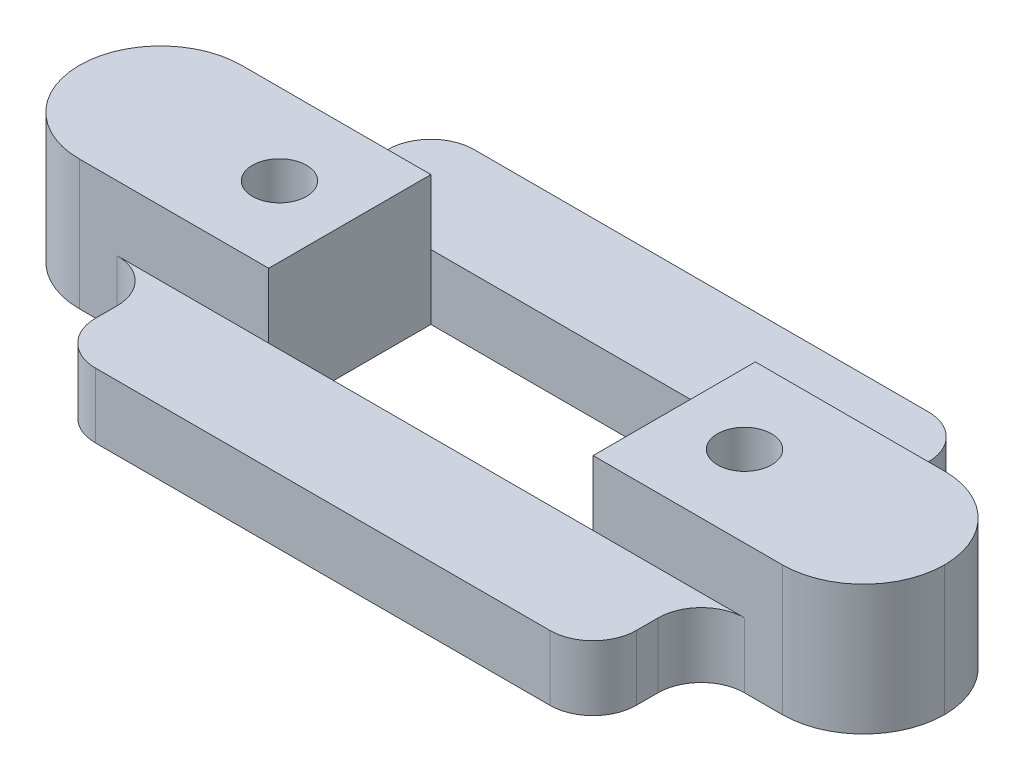
ISO-10303-21;
HEADER;
FILE_DESCRIPTION(('STEP AP214'),'2;1');
FILE_NAME('part.step','',(''),(''),'','','');
FILE_SCHEMA(('AUTOMOTIVE_DESIGN { 1 0 10303 214 1 1 1 1 }'));
ENDSEC;
DATA;
#1=APPLICATION_CONTEXT('core data for automotive mechanical design processes');
#2=APPLICATION_PROTOCOL_DEFINITION('international standard','automotive_design',2000,#1);
#3=PRODUCT_CONTEXT('',#1,'mechanical');
#4=PRODUCT('Part','Part','',(#3));
#5=PRODUCT_RELATED_PRODUCT_CATEGORY('part','',(#4));
#6=PRODUCT_DEFINITION_FORMATION('','',#4);
#7=PRODUCT_DEFINITION_CONTEXT('part definition',#1,'design');
#8=PRODUCT_DEFINITION('design','',#6,#7);
#9=PRODUCT_DEFINITION_SHAPE('','',#8);
#10=(LENGTH_UNIT() NAMED_UNIT(*) SI_UNIT(.MILLI.,.METRE.));
#11=(NAMED_UNIT(*) PLANE_ANGLE_UNIT() SI_UNIT($,.RADIAN.));
#12=(NAMED_UNIT(*) SI_UNIT($,.STERADIAN.) SOLID_ANGLE_UNIT());
#13=UNCERTAINTY_MEASURE_WITH_UNIT(LENGTH_MEASURE(1.E-05),#10,'distance_accuracy_value','');
#14=(GEOMETRIC_REPRESENTATION_CONTEXT(3) GLOBAL_UNCERTAINTY_ASSIGNED_CONTEXT((#13)) GLOBAL_UNIT_ASSIGNED_CONTEXT((#10,
#11,#12)) REPRESENTATION_CONTEXT('',''));
#15=CARTESIAN_POINT('',(0.,0.,0.));
#16=DIRECTION('',(0.,0.,1.));
#17=DIRECTION('',(1.,0.,0.));
#18=AXIS2_PLACEMENT_3D('',#15,#16,#17);
#19=CARTESIAN_POINT('',(0.,6.,0.));
#20=DIRECTION('',(0.,-1.,0.));
#21=DIRECTION('',(0.,0.,-1.));
#22=AXIS2_PLACEMENT_3D('',#19,#20,#21);
#23=PLANE('',#22);
#24=CARTESIAN_POINT('',(10.75,6.,0.));
#25=DIRECTION('',(0.,1.,0.));
#26=DIRECTION('',(0.,0.,-1.));
#27=AXIS2_PLACEMENT_3D('',#24,#25,#26);
#28=CIRCLE('',#27,1.25);
#29=CARTESIAN_POINT('',(10.75,6.,-1.25));
#30=VERTEX_POINT('',#29);
#31=EDGE_CURVE('E274',#30,#30,#28,.T.);
#32=ORIENTED_EDGE('',*,*,#31,.F.);
#33=EDGE_LOOP('',(#32));
#34=FACE_BOUND('',#33,.T.);
#35=DIRECTION('',(-1.,0.,0.));
#36=VECTOR('',#35,1.);
#37=CARTESIAN_POINT('',(12.5,6.,-3.75));
#38=LINE('',#37,#36);
#39=CARTESIAN_POINT('',(16.25,6.,-3.75));
#40=VERTEX_POINT('',#39);
#41=CARTESIAN_POINT('',(7.5,6.,-3.75));
#42=VERTEX_POINT('',#41);
#43=EDGE_CURVE('E304',#40,#42,#38,.T.);
#44=ORIENTED_EDGE('',*,*,#43,.T.);
#45=DIRECTION('',(0.,0.,-1.));
#46=VECTOR('',#45,1.);
#47=CARTESIAN_POINT('',(7.5,6.,3.75));
#48=LINE('',#47,#46);
#49=CARTESIAN_POINT('',(7.5,6.,3.75));
#50=VERTEX_POINT('',#49);
#51=EDGE_CURVE('E262',#50,#42,#48,.T.);
#52=ORIENTED_EDGE('',*,*,#51,.F.);
#53=DIRECTION('',(1.,0.,0.));
#54=VECTOR('',#53,1.);
#55=CARTESIAN_POINT('',(12.5,6.,3.75));
#56=LINE('',#55,#54);
#57=CARTESIAN_POINT('',(16.25,6.,3.75));
#58=VERTEX_POINT('',#57);
#59=EDGE_CURVE('E300',#50,#58,#56,.T.);
#60=ORIENTED_EDGE('',*,*,#59,.T.);
#61=CARTESIAN_POINT('',(16.25,6.,0.));
#62=DIRECTION('',(0.,-1.,0.));
#63=DIRECTION('',(0.,0.,-1.));
#64=AXIS2_PLACEMENT_3D('',#61,#62,#63);
#65=CIRCLE('',#64,3.75);
#66=CARTESIAN_POINT('',(20.,6.,0.));
#67=VERTEX_POINT('',#66);
#68=EDGE_CURVE('E369',#58,#67,#65,.F.);
#69=ORIENTED_EDGE('',*,*,#68,.T.);
#70=CARTESIAN_POINT('',(16.25,6.,0.));
#71=DIRECTION('',(0.,-1.,0.));
#72=DIRECTION('',(0.,0.,-1.));
#73=AXIS2_PLACEMENT_3D('',#70,#71,#72);
#74=CIRCLE('',#73,3.75);
#75=EDGE_CURVE('E366',#67,#40,#74,.F.);
#76=ORIENTED_EDGE('',*,*,#75,.T.);
#77=EDGE_LOOP('',(#44,#52,#60,#69,#76));
#78=FACE_BOUND('',#77,.T.);
#79=ADVANCED_FACE('F43',(#34,#78),#23,.F.);
#80=CARTESIAN_POINT('',(-10.75,6.,0.));
#81=DIRECTION('',(0.,1.,0.));
#82=DIRECTION('',(0.,0.,1.));
#83=AXIS2_PLACEMENT_3D('',#80,#81,#82);
#84=CIRCLE('',#83,1.25);
#85=CARTESIAN_POINT('',(-10.75,6.,1.25));
#86=VERTEX_POINT('',#85);
#87=EDGE_CURVE('E282',#86,#86,#84,.T.);
#88=ORIENTED_EDGE('',*,*,#87,.F.);
#89=EDGE_LOOP('',(#88));
#90=FACE_BOUND('',#89,.T.);
#91=DIRECTION('',(0.,0.,1.));
#92=VECTOR('',#91,1.);
#93=CARTESIAN_POINT('',(-7.5,6.,-3.75));
#94=LINE('',#93,#92);
#95=CARTESIAN_POINT('',(-7.5,6.,-3.75));
#96=VERTEX_POINT('',#95);
#97=CARTESIAN_POINT('',(-7.5,6.,3.75));
#98=VERTEX_POINT('',#97);
#99=EDGE_CURVE('E234',#96,#98,#94,.T.);
#100=ORIENTED_EDGE('',*,*,#99,.F.);
#101=DIRECTION('',(-1.,0.,0.));
#102=VECTOR('',#101,1.);
#103=CARTESIAN_POINT('',(-20.,6.,-3.75));
#104=LINE('',#103,#102);
#105=CARTESIAN_POINT('',(-16.25,6.,-3.75));
#106=VERTEX_POINT('',#105);
#107=EDGE_CURVE('E241',#96,#106,#104,.T.);
#108=ORIENTED_EDGE('',*,*,#107,.T.);
#109=CARTESIAN_POINT('',(-16.25,6.,0.));
#110=DIRECTION('',(0.,-1.,0.));
#111=DIRECTION('',(0.,0.,-1.));
#112=AXIS2_PLACEMENT_3D('',#109,#110,#111);
#113=CIRCLE('',#112,3.75);
#114=CARTESIAN_POINT('',(-20.,6.,0.));
#115=VERTEX_POINT('',#114);
#116=EDGE_CURVE('E361',#106,#115,#113,.F.);
#117=ORIENTED_EDGE('',*,*,#116,.T.);
#118=CARTESIAN_POINT('',(-16.25,6.,0.));
#119=DIRECTION('',(0.,-1.,0.));
#120=DIRECTION('',(0.,0.,-1.));
#121=AXIS2_PLACEMENT_3D('',#118,#119,#120);
#122=CIRCLE('',#121,3.75);
#123=CARTESIAN_POINT('',(-16.25,6.,3.75));
#124=VERTEX_POINT('',#123);
#125=EDGE_CURVE('E236',#115,#124,#122,.F.);
#126=ORIENTED_EDGE('',*,*,#125,.T.);
#127=DIRECTION('',(1.,0.,0.));
#128=VECTOR('',#127,1.);
#129=CARTESIAN_POINT('',(-20.,6.,3.75));
#130=LINE('',#129,#128);
#131=EDGE_CURVE('E229',#124,#98,#130,.T.);
#132=ORIENTED_EDGE('',*,*,#131,.T.);
#133=EDGE_LOOP('',(#100,#108,#117,#126,#132));
#134=FACE_BOUND('',#133,.T.);
#135=ADVANCED_FACE('F231',(#90,#134),#23,.F.);
#136=CARTESIAN_POINT('',(12.5,6.,-8.75));
#137=DIRECTION('',(-1.,0.,0.));
#138=DIRECTION('',(0.,0.,1.));
#139=AXIS2_PLACEMENT_3D('',#136,#137,#138);
#140=PLANE('',#139);
#141=DIRECTION('',(0.,0.,-1.));
#142=VECTOR('',#141,1.);
#143=CARTESIAN_POINT('',(12.5,0.,-8.75));
#144=LINE('',#143,#142);
#145=CARTESIAN_POINT('',(12.5,0.,-5.75));
#146=VERTEX_POINT('',#145);
#147=CARTESIAN_POINT('',(12.5,0.,-6.75));
#148=VERTEX_POINT('',#147);
#149=EDGE_CURVE('E316',#146,#148,#144,.T.);
#150=ORIENTED_EDGE('',*,*,#149,.T.);
#151=DIRECTION('',(0.,-1.,0.));
#152=VECTOR('',#151,1.);
#153=CARTESIAN_POINT('',(12.5,6.,-6.75));
#154=LINE('',#153,#152);
#155=CARTESIAN_POINT('',(12.5,3.,-6.75));
#156=VERTEX_POINT('',#155);
#157=EDGE_CURVE('E447',#148,#156,#154,.F.);
#158=ORIENTED_EDGE('',*,*,#157,.T.);
#159=DIRECTION('',(0.,0.,-1.));
#160=VECTOR('',#159,1.);
#161=CARTESIAN_POINT('',(12.5,3.,-8.75));
#162=LINE('',#161,#160);
#163=CARTESIAN_POINT('',(12.5,3.,-5.75));
#164=VERTEX_POINT('',#163);
#165=EDGE_CURVE('E390',#164,#156,#162,.T.);
#166=ORIENTED_EDGE('',*,*,#165,.F.);
#167=DIRECTION('',(0.,-1.,0.));
#168=VECTOR('',#167,1.);
#169=CARTESIAN_POINT('',(12.5,0.,-5.75));
#170=LINE('',#169,#168);
#171=EDGE_CURVE('E443',#164,#146,#170,.T.);
#172=ORIENTED_EDGE('',*,*,#171,.T.);
#173=EDGE_LOOP('',(#150,#158,#166,#172));
#174=FACE_BOUND('',#173,.T.);
#175=ADVANCED_FACE('F628',(#174),#140,.F.);
#176=CARTESIAN_POINT('',(-12.5,6.,-8.75));
#177=DIRECTION('',(0.,0.,1.));
#178=DIRECTION('',(1.,0.,0.));
#179=AXIS2_PLACEMENT_3D('',#176,#177,#178);
#180=PLANE('',#179);
#181=DIRECTION('',(1.,0.,0.));
#182=VECTOR('',#181,1.);
#183=CARTESIAN_POINT('',(-20.,3.,-8.75));
#184=LINE('',#183,#182);
#185=CARTESIAN_POINT('',(-10.5,3.,-8.75));
#186=VERTEX_POINT('',#185);
#187=CARTESIAN_POINT('',(10.5,3.,-8.75));
#188=VERTEX_POINT('',#187);
#189=EDGE_CURVE('E577',#186,#188,#184,.T.);
#190=ORIENTED_EDGE('',*,*,#189,.T.);
#191=DIRECTION('',(0.,-1.,0.));
#192=VECTOR('',#191,1.);
#193=CARTESIAN_POINT('',(10.5,6.,-8.75));
#194=LINE('',#193,#192);
#195=CARTESIAN_POINT('',(10.5,0.,-8.75));
#196=VERTEX_POINT('',#195);
#197=EDGE_CURVE('E439',#188,#196,#194,.T.);
#198=ORIENTED_EDGE('',*,*,#197,.T.);
#199=DIRECTION('',(-1.,0.,0.));
#200=VECTOR('',#199,1.);
#201=CARTESIAN_POINT('',(-12.5,0.,-8.75));
#202=LINE('',#201,#200);
#203=CARTESIAN_POINT('',(-10.5,0.,-8.75));
#204=VERTEX_POINT('',#203);
#205=EDGE_CURVE('E320',#196,#204,#202,.T.);
#206=ORIENTED_EDGE('',*,*,#205,.T.);
#207=DIRECTION('',(0.,-1.,0.));
#208=VECTOR('',#207,1.);
#209=CARTESIAN_POINT('',(-10.5,6.,-8.75));
#210=LINE('',#209,#208);
#211=EDGE_CURVE('E436',#204,#186,#210,.F.);
#212=ORIENTED_EDGE('',*,*,#211,.T.);
#213=EDGE_LOOP('',(#190,#198,#206,#212));
#214=FACE_BOUND('',#213,.T.);
#215=ADVANCED_FACE('F625',(#214),#180,.F.);
#216=CARTESIAN_POINT('',(-12.5,6.,-3.75));
#217=DIRECTION('',(1.,0.,0.));
#218=DIRECTION('',(0.,0.,-1.));
#219=AXIS2_PLACEMENT_3D('',#216,#217,#218);
#220=PLANE('',#219);
#221=DIRECTION('',(0.,0.,1.));
#222=VECTOR('',#221,1.);
#223=CARTESIAN_POINT('',(-12.5,3.,-3.75));
#224=LINE('',#223,#222);
#225=CARTESIAN_POINT('',(-12.5,3.,-6.75));
#226=VERTEX_POINT('',#225);
#227=CARTESIAN_POINT('',(-12.5,3.,-5.75));
#228=VERTEX_POINT('',#227);
#229=EDGE_CURVE('E505',#226,#228,#224,.T.);
#230=ORIENTED_EDGE('',*,*,#229,.F.);
#231=DIRECTION('',(0.,-1.,0.));
#232=VECTOR('',#231,1.);
#233=CARTESIAN_POINT('',(-12.5,6.,-6.75));
#234=LINE('',#233,#232);
#235=CARTESIAN_POINT('',(-12.5,0.,-6.75));
#236=VERTEX_POINT('',#235);
#237=EDGE_CURVE('E462',#226,#236,#234,.T.);
#238=ORIENTED_EDGE('',*,*,#237,.T.);
#239=DIRECTION('',(0.,0.,1.));
#240=VECTOR('',#239,1.);
#241=CARTESIAN_POINT('',(-12.5,0.,-3.75));
#242=LINE('',#241,#240);
#243=CARTESIAN_POINT('',(-12.5,0.,-5.75));
#244=VERTEX_POINT('',#243);
#245=EDGE_CURVE('E324',#236,#244,#242,.T.);
#246=ORIENTED_EDGE('',*,*,#245,.T.);
#247=DIRECTION('',(0.,-1.,0.));
#248=VECTOR('',#247,1.);
#249=CARTESIAN_POINT('',(-12.5,3.,-5.75));
#250=LINE('',#249,#248);
#251=EDGE_CURVE('E459',#244,#228,#250,.F.);
#252=ORIENTED_EDGE('',*,*,#251,.T.);
#253=EDGE_LOOP('',(#230,#238,#246,#252));
#254=FACE_BOUND('',#253,.T.);
#255=ADVANCED_FACE('F499',(#254),#220,.F.);
#256=CARTESIAN_POINT('',(-12.5,6.,3.75));
#257=DIRECTION('',(1.,0.,0.));
#258=DIRECTION('',(0.,0.,-1.));
#259=AXIS2_PLACEMENT_3D('',#256,#257,#258);
#260=PLANE('',#259);
#261=DIRECTION('',(0.,0.,1.));
#262=VECTOR('',#261,1.);
#263=CARTESIAN_POINT('',(-12.5,0.,3.75));
#264=LINE('',#263,#262);
#265=CARTESIAN_POINT('',(-12.5,0.,5.75));
#266=VERTEX_POINT('',#265);
#267=CARTESIAN_POINT('',(-12.5,0.,6.75));
#268=VERTEX_POINT('',#267);
#269=EDGE_CURVE('E334',#266,#268,#264,.T.);
#270=ORIENTED_EDGE('',*,*,#269,.T.);
#271=DIRECTION('',(0.,-1.,0.));
#272=VECTOR('',#271,1.);
#273=CARTESIAN_POINT('',(-12.5,6.,6.75));
#274=LINE('',#273,#272);
#275=CARTESIAN_POINT('',(-12.5,3.,6.75));
#276=VERTEX_POINT('',#275);
#277=EDGE_CURVE('E430',#268,#276,#274,.F.);
#278=ORIENTED_EDGE('',*,*,#277,.T.);
#279=DIRECTION('',(0.,0.,1.));
#280=VECTOR('',#279,1.);
#281=CARTESIAN_POINT('',(-12.5,3.,3.75));
#282=LINE('',#281,#280);
#283=CARTESIAN_POINT('',(-12.5,3.,5.75));
#284=VERTEX_POINT('',#283);
#285=EDGE_CURVE('E509',#284,#276,#282,.T.);
#286=ORIENTED_EDGE('',*,*,#285,.F.);
#287=DIRECTION('',(0.,-1.,0.));
#288=VECTOR('',#287,1.);
#289=CARTESIAN_POINT('',(-12.5,0.,5.75));
#290=LINE('',#289,#288);
#291=EDGE_CURVE('E426',#284,#266,#290,.T.);
#292=ORIENTED_EDGE('',*,*,#291,.T.);
#293=EDGE_LOOP('',(#270,#278,#286,#292));
#294=FACE_BOUND('',#293,.T.);
#295=ADVANCED_FACE('F613',(#294),#260,.F.);
#296=CARTESIAN_POINT('',(-12.5,6.,8.75));
#297=DIRECTION('',(0.,0.,-1.));
#298=DIRECTION('',(-1.,0.,0.));
#299=AXIS2_PLACEMENT_3D('',#296,#297,#298);
#300=PLANE('',#299);
#301=DIRECTION('',(1.,0.,0.));
#302=VECTOR('',#301,1.);
#303=CARTESIAN_POINT('',(-12.5,0.,8.75));
#304=LINE('',#303,#302);
#305=CARTESIAN_POINT('',(-10.5,0.,8.75));
#306=VERTEX_POINT('',#305);
#307=CARTESIAN_POINT('',(10.5,0.,8.75));
#308=VERTEX_POINT('',#307);
#309=EDGE_CURVE('E338',#306,#308,#304,.T.);
#310=ORIENTED_EDGE('',*,*,#309,.T.);
#311=DIRECTION('',(0.,-1.,0.));
#312=VECTOR('',#311,1.);
#313=CARTESIAN_POINT('',(10.5,6.,8.75));
#314=LINE('',#313,#312);
#315=CARTESIAN_POINT('',(10.5,3.,8.75));
#316=VERTEX_POINT('',#315);
#317=EDGE_CURVE('E417',#308,#316,#314,.F.);
#318=ORIENTED_EDGE('',*,*,#317,.T.);
#319=DIRECTION('',(1.,0.,0.));
#320=VECTOR('',#319,1.);
#321=CARTESIAN_POINT('',(-20.,3.,8.75));
#322=LINE('',#321,#320);
#323=CARTESIAN_POINT('',(-10.5,3.,8.75));
#324=VERTEX_POINT('',#323);
#325=EDGE_CURVE('E571',#324,#316,#322,.T.);
#326=ORIENTED_EDGE('',*,*,#325,.F.);
#327=DIRECTION('',(0.,-1.,0.));
#328=VECTOR('',#327,1.);
#329=CARTESIAN_POINT('',(-10.5,6.,8.75));
#330=LINE('',#329,#328);
#331=EDGE_CURVE('E413',#324,#306,#330,.T.);
#332=ORIENTED_EDGE('',*,*,#331,.T.);
#333=EDGE_LOOP('',(#310,#318,#326,#332));
#334=FACE_BOUND('',#333,.T.);
#335=ADVANCED_FACE('F609',(#334),#300,.F.);
#336=CARTESIAN_POINT('',(12.5,6.,8.75));
#337=DIRECTION('',(-1.,0.,0.));
#338=DIRECTION('',(0.,0.,1.));
#339=AXIS2_PLACEMENT_3D('',#336,#337,#338);
#340=PLANE('',#339);
#341=DIRECTION('',(0.,0.,-1.));
#342=VECTOR('',#341,1.);
#343=CARTESIAN_POINT('',(12.5,0.,8.75));
#344=LINE('',#343,#342);
#345=CARTESIAN_POINT('',(12.5,0.,6.75));
#346=VERTEX_POINT('',#345);
#347=CARTESIAN_POINT('',(12.5,0.,5.75));
#348=VERTEX_POINT('',#347);
#349=EDGE_CURVE('E305',#346,#348,#344,.T.);
#350=ORIENTED_EDGE('',*,*,#349,.T.);
#351=DIRECTION('',(0.,-1.,0.));
#352=VECTOR('',#351,1.);
#353=CARTESIAN_POINT('',(12.5,3.,5.75));
#354=LINE('',#353,#352);
#355=CARTESIAN_POINT('',(12.5,3.,5.75));
#356=VERTEX_POINT('',#355);
#357=EDGE_CURVE('E398',#348,#356,#354,.F.);
#358=ORIENTED_EDGE('',*,*,#357,.T.);
#359=DIRECTION('',(0.,0.,-1.));
#360=VECTOR('',#359,1.);
#361=CARTESIAN_POINT('',(12.5,3.,8.75));
#362=LINE('',#361,#360);
#363=CARTESIAN_POINT('',(12.5,3.,6.75));
#364=VERTEX_POINT('',#363);
#365=EDGE_CURVE('E515',#364,#356,#362,.T.);
#366=ORIENTED_EDGE('',*,*,#365,.F.);
#367=DIRECTION('',(0.,-1.,0.));
#368=VECTOR('',#367,1.);
#369=CARTESIAN_POINT('',(12.5,6.,6.75));
#370=LINE('',#369,#368);
#371=EDGE_CURVE('E394',#364,#346,#370,.T.);
#372=ORIENTED_EDGE('',*,*,#371,.T.);
#373=EDGE_LOOP('',(#350,#358,#366,#372));
#374=FACE_BOUND('',#373,.T.);
#375=ADVANCED_FACE('F606',(#374),#340,.F.);
#376=CARTESIAN_POINT('',(-7.5,6.,3.75));
#377=DIRECTION('',(0.,0.,-1.));
#378=DIRECTION('',(-1.,0.,0.));
#379=AXIS2_PLACEMENT_3D('',#376,#377,#378);
#380=PLANE('',#379);
#381=DIRECTION('',(0.,-1.,0.));
#382=VECTOR('',#381,1.);
#383=CARTESIAN_POINT('',(-7.5,6.,3.75));
#384=LINE('',#383,#382);
#385=CARTESIAN_POINT('',(-7.5,3.,3.75));
#386=VERTEX_POINT('',#385);
#387=CARTESIAN_POINT('',(-7.5,0.,3.75));
#388=VERTEX_POINT('',#387);
#389=EDGE_CURVE('E254',#386,#388,#384,.T.);
#390=ORIENTED_EDGE('',*,*,#389,.F.);
#391=DIRECTION('',(1.,0.,0.));
#392=VECTOR('',#391,1.);
#393=CARTESIAN_POINT('',(-20.,3.,3.75));
#394=LINE('',#393,#392);
#395=CARTESIAN_POINT('',(7.5,3.,3.75));
#396=VERTEX_POINT('',#395);
#397=EDGE_CURVE('E560',#386,#396,#394,.T.);
#398=ORIENTED_EDGE('',*,*,#397,.T.);
#399=DIRECTION('',(0.,-1.,0.));
#400=VECTOR('',#399,1.);
#401=CARTESIAN_POINT('',(7.5,6.,3.75));
#402=LINE('',#401,#400);
#403=CARTESIAN_POINT('',(7.5,0.,3.75));
#404=VERTEX_POINT('',#403);
#405=EDGE_CURVE('E296',#396,#404,#402,.T.);
#406=ORIENTED_EDGE('',*,*,#405,.T.);
#407=DIRECTION('',(1.,0.,0.));
#408=VECTOR('',#407,1.);
#409=CARTESIAN_POINT('',(-7.5,0.,3.75));
#410=LINE('',#409,#408);
#411=EDGE_CURVE('E281',#388,#404,#410,.T.);
#412=ORIENTED_EDGE('',*,*,#411,.F.);
#413=EDGE_LOOP('',(#390,#398,#406,#412));
#414=FACE_BOUND('',#413,.T.);
#415=ADVANCED_FACE('F567',(#414),#380,.T.);
#416=CARTESIAN_POINT('',(-7.5,6.,-3.75));
#417=DIRECTION('',(0.,0.,1.));
#418=DIRECTION('',(1.,0.,0.));
#419=AXIS2_PLACEMENT_3D('',#416,#417,#418);
#420=PLANE('',#419);
#421=DIRECTION('',(0.,-1.,0.));
#422=VECTOR('',#421,1.);
#423=CARTESIAN_POINT('',(7.5,6.,-3.75));
#424=LINE('',#423,#422);
#425=CARTESIAN_POINT('',(7.5,3.,-3.75));
#426=VERTEX_POINT('',#425);
#427=CARTESIAN_POINT('',(7.5,0.,-3.75));
#428=VERTEX_POINT('',#427);
#429=EDGE_CURVE('E291',#426,#428,#424,.T.);
#430=ORIENTED_EDGE('',*,*,#429,.F.);
#431=DIRECTION('',(1.,0.,0.));
#432=VECTOR('',#431,1.);
#433=CARTESIAN_POINT('',(-20.,3.,-3.75));
#434=LINE('',#433,#432);
#435=CARTESIAN_POINT('',(-7.5,3.,-3.75));
#436=VERTEX_POINT('',#435);
#437=EDGE_CURVE('E584',#436,#426,#434,.T.);
#438=ORIENTED_EDGE('',*,*,#437,.F.);
#439=DIRECTION('',(0.,-1.,0.));
#440=VECTOR('',#439,1.);
#441=CARTESIAN_POINT('',(-7.5,6.,-3.75));
#442=LINE('',#441,#440);
#443=CARTESIAN_POINT('',(-7.5,0.,-3.75));
#444=VERTEX_POINT('',#443);
#445=EDGE_CURVE('E268',#436,#444,#442,.T.);
#446=ORIENTED_EDGE('',*,*,#445,.T.);
#447=DIRECTION('',(-1.,0.,0.));
#448=VECTOR('',#447,1.);
#449=CARTESIAN_POINT('',(-7.5,0.,-3.75));
#450=LINE('',#449,#448);
#451=EDGE_CURVE('E263',#428,#444,#450,.T.);
#452=ORIENTED_EDGE('',*,*,#451,.F.);
#453=EDGE_LOOP('',(#430,#438,#446,#452));
#454=FACE_BOUND('',#453,.T.);
#455=ADVANCED_FACE('F591',(#454),#420,.T.);
#456=CARTESIAN_POINT('',(0.,0.,0.));
#457=DIRECTION('',(0.,-1.,0.));
#458=DIRECTION('',(0.,0.,-1.));
#459=AXIS2_PLACEMENT_3D('',#456,#457,#458);
#460=PLANE('',#459);
#461=CARTESIAN_POINT('',(-10.75,0.,0.));
#462=DIRECTION('',(0.,1.,0.));
#463=DIRECTION('',(0.,0.,1.));
#464=AXIS2_PLACEMENT_3D('',#461,#462,#463);
#465=CIRCLE('',#464,1.25);
#466=CARTESIAN_POINT('',(-10.75,0.,1.25));
#467=VERTEX_POINT('',#466);
#468=EDGE_CURVE('E522',#467,#467,#465,.T.);
#469=ORIENTED_EDGE('',*,*,#468,.T.);
#470=EDGE_LOOP('',(#469));
#471=FACE_BOUND('',#470,.T.);
#472=CARTESIAN_POINT('',(10.75,0.,0.));
#473=DIRECTION('',(0.,1.,0.));
#474=DIRECTION('',(0.,0.,-1.));
#475=AXIS2_PLACEMENT_3D('',#472,#473,#474);
#476=CIRCLE('',#475,1.25);
#477=CARTESIAN_POINT('',(10.75,0.,-1.25));
#478=VERTEX_POINT('',#477);
#479=EDGE_CURVE('E525',#478,#478,#476,.T.);
#480=ORIENTED_EDGE('',*,*,#479,.T.);
#481=EDGE_LOOP('',(#480));
#482=FACE_BOUND('',#481,.T.);
#483=ORIENTED_EDGE('',*,*,#349,.F.);
#484=CARTESIAN_POINT('',(10.5,0.,6.75));
#485=DIRECTION('',(0.,-1.,0.));
#486=DIRECTION('',(0.,0.,-1.));
#487=AXIS2_PLACEMENT_3D('',#484,#485,#486);
#488=CIRCLE('',#487,2.);
#489=EDGE_CURVE('E410',#346,#308,#488,.T.);
#490=ORIENTED_EDGE('',*,*,#489,.T.);
#491=ORIENTED_EDGE('',*,*,#309,.F.);
#492=CARTESIAN_POINT('',(-10.5,0.,6.75));
#493=DIRECTION('',(0.,-1.,0.));
#494=DIRECTION('',(0.,0.,-1.));
#495=AXIS2_PLACEMENT_3D('',#492,#493,#494);
#496=CIRCLE('',#495,2.);
#497=EDGE_CURVE('E407',#306,#268,#496,.T.);
#498=ORIENTED_EDGE('',*,*,#497,.T.);
#499=ORIENTED_EDGE('',*,*,#269,.F.);
#500=CARTESIAN_POINT('',(-14.5,0.,5.75));
#501=DIRECTION('',(0.,-1.,0.));
#502=DIRECTION('',(0.,0.,-1.));
#503=AXIS2_PLACEMENT_3D('',#500,#501,#502);
#504=CIRCLE('',#503,2.);
#505=CARTESIAN_POINT('',(-14.5,0.,3.75));
#506=VERTEX_POINT('',#505);
#507=EDGE_CURVE('E476',#266,#506,#504,.F.);
#508=ORIENTED_EDGE('',*,*,#507,.T.);
#509=DIRECTION('',(1.,0.,0.));
#510=VECTOR('',#509,1.);
#511=CARTESIAN_POINT('',(-20.,0.,3.75));
#512=LINE('',#511,#510);
#513=CARTESIAN_POINT('',(-16.25,0.,3.75));
#514=VERTEX_POINT('',#513);
#515=EDGE_CURVE('E331',#514,#506,#512,.T.);
#516=ORIENTED_EDGE('',*,*,#515,.F.);
#517=CARTESIAN_POINT('',(-16.25,0.,0.));
#518=DIRECTION('',(0.,-1.,0.));
#519=DIRECTION('',(0.,0.,-1.));
#520=AXIS2_PLACEMENT_3D('',#517,#518,#519);
#521=CIRCLE('',#520,3.75);
#522=CARTESIAN_POINT('',(-20.,0.,0.));
#523=VERTEX_POINT('',#522);
#524=EDGE_CURVE('E348',#514,#523,#521,.T.);
#525=ORIENTED_EDGE('',*,*,#524,.T.);
#526=CARTESIAN_POINT('',(-16.25,0.,0.));
#527=DIRECTION('',(0.,-1.,0.));
#528=DIRECTION('',(0.,0.,-1.));
#529=AXIS2_PLACEMENT_3D('',#526,#527,#528);
#530=CIRCLE('',#529,3.75);
#531=CARTESIAN_POINT('',(-16.25,0.,-3.75));
#532=VERTEX_POINT('',#531);
#533=EDGE_CURVE('E240',#523,#532,#530,.T.);
#534=ORIENTED_EDGE('',*,*,#533,.T.);
#535=DIRECTION('',(-1.,0.,0.));
#536=VECTOR('',#535,1.);
#537=CARTESIAN_POINT('',(-20.,0.,-3.75));
#538=LINE('',#537,#536);
#539=CARTESIAN_POINT('',(-14.5,0.,-3.75));
#540=VERTEX_POINT('',#539);
#541=EDGE_CURVE('E328',#540,#532,#538,.T.);
#542=ORIENTED_EDGE('',*,*,#541,.F.);
#543=CARTESIAN_POINT('',(-14.5,0.,-5.75));
#544=DIRECTION('',(0.,-1.,0.));
#545=DIRECTION('',(0.,0.,-1.));
#546=AXIS2_PLACEMENT_3D('',#543,#544,#545);
#547=CIRCLE('',#546,2.);
#548=EDGE_CURVE('E52',#540,#244,#547,.F.);
#549=ORIENTED_EDGE('',*,*,#548,.T.);
#550=ORIENTED_EDGE('',*,*,#245,.F.);
#551=CARTESIAN_POINT('',(-10.5,0.,-6.75));
#552=DIRECTION('',(0.,-1.,0.));
#553=DIRECTION('',(0.,0.,-1.));
#554=AXIS2_PLACEMENT_3D('',#551,#552,#553);
#555=CIRCLE('',#554,2.);
#556=EDGE_CURVE('E401',#236,#204,#555,.T.);
#557=ORIENTED_EDGE('',*,*,#556,.T.);
#558=ORIENTED_EDGE('',*,*,#205,.F.);
#559=CARTESIAN_POINT('',(10.5,0.,-6.75));
#560=DIRECTION('',(0.,-1.,0.));
#561=DIRECTION('',(0.,0.,-1.));
#562=AXIS2_PLACEMENT_3D('',#559,#560,#561);
#563=CIRCLE('',#562,2.);
#564=EDGE_CURVE('E404',#196,#148,#563,.T.);
#565=ORIENTED_EDGE('',*,*,#564,.T.);
#566=ORIENTED_EDGE('',*,*,#149,.F.);
#567=CARTESIAN_POINT('',(14.5,0.,-5.75));
#568=DIRECTION('',(0.,-1.,0.));
#569=DIRECTION('',(0.,0.,-1.));
#570=AXIS2_PLACEMENT_3D('',#567,#568,#569);
#571=CIRCLE('',#570,2.);
#572=CARTESIAN_POINT('',(14.5,0.,-3.75));
#573=VERTEX_POINT('',#572);
#574=EDGE_CURVE('E482',#146,#573,#571,.F.);
#575=ORIENTED_EDGE('',*,*,#574,.T.);
#576=DIRECTION('',(-1.,0.,0.));
#577=VECTOR('',#576,1.);
#578=CARTESIAN_POINT('',(12.5,0.,-3.75));
#579=LINE('',#578,#577);
#580=CARTESIAN_POINT('',(16.25,0.,-3.75));
#581=VERTEX_POINT('',#580);
#582=EDGE_CURVE('E312',#581,#573,#579,.T.);
#583=ORIENTED_EDGE('',*,*,#582,.F.);
#584=CARTESIAN_POINT('',(16.25,0.,0.));
#585=DIRECTION('',(0.,-1.,0.));
#586=DIRECTION('',(0.,0.,-1.));
#587=AXIS2_PLACEMENT_3D('',#584,#585,#586);
#588=CIRCLE('',#587,3.75);
#589=CARTESIAN_POINT('',(20.,0.,0.));
#590=VERTEX_POINT('',#589);
#591=EDGE_CURVE('E351',#581,#590,#588,.T.);
#592=ORIENTED_EDGE('',*,*,#591,.T.);
#593=CARTESIAN_POINT('',(16.25,0.,0.));
#594=DIRECTION('',(0.,-1.,0.));
#595=DIRECTION('',(0.,0.,-1.));
#596=AXIS2_PLACEMENT_3D('',#593,#594,#595);
#597=CIRCLE('',#596,3.75);
#598=CARTESIAN_POINT('',(16.25,0.,3.75));
#599=VERTEX_POINT('',#598);
#600=EDGE_CURVE('E354',#590,#599,#597,.T.);
#601=ORIENTED_EDGE('',*,*,#600,.T.);
#602=DIRECTION('',(1.,0.,0.));
#603=VECTOR('',#602,1.);
#604=CARTESIAN_POINT('',(12.5,0.,3.75));
#605=LINE('',#604,#603);
#606=CARTESIAN_POINT('',(14.5,0.,3.75));
#607=VERTEX_POINT('',#606);
#608=EDGE_CURVE('E253',#607,#599,#605,.T.);
#609=ORIENTED_EDGE('',*,*,#608,.F.);
#610=CARTESIAN_POINT('',(14.5,0.,5.75));
#611=DIRECTION('',(0.,-1.,0.));
#612=DIRECTION('',(0.,0.,-1.));
#613=AXIS2_PLACEMENT_3D('',#610,#611,#612);
#614=CIRCLE('',#613,2.);
#615=EDGE_CURVE('E469',#607,#348,#614,.F.);
#616=ORIENTED_EDGE('',*,*,#615,.T.);
#617=EDGE_LOOP('',(#483,#490,#491,#498,#499,#508,#516,#525,#534,#542,#549,#550,#557,#558,#565,
#566,#575,#583,#592,#601,#609,#616));
#618=FACE_BOUND('',#617,.T.);
#619=ORIENTED_EDGE('',*,*,#451,.T.);
#620=DIRECTION('',(0.,0.,1.));
#621=VECTOR('',#620,1.);
#622=CARTESIAN_POINT('',(-7.5,0.,-3.75));
#623=LINE('',#622,#621);
#624=EDGE_CURVE('E277',#444,#388,#623,.T.);
#625=ORIENTED_EDGE('',*,*,#624,.T.);
#626=ORIENTED_EDGE('',*,*,#411,.T.);
#627=DIRECTION('',(0.,0.,-1.));
#628=VECTOR('',#627,1.);
#629=CARTESIAN_POINT('',(7.5,0.,3.75));
#630=LINE('',#629,#628);
#631=EDGE_CURVE('E271',#404,#428,#630,.T.);
#632=ORIENTED_EDGE('',*,*,#631,.T.);
#633=EDGE_LOOP('',(#619,#625,#626,#632));
#634=FACE_BOUND('',#633,.T.);
#635=ADVANCED_FACE('F492',(#471,#482,#618,#634),#460,.T.);
#636=CARTESIAN_POINT('',(12.5,6.,3.75));
#637=DIRECTION('',(0.,0.,-1.));
#638=DIRECTION('',(-1.,0.,0.));
#639=AXIS2_PLACEMENT_3D('',#636,#637,#638);
#640=PLANE('',#639);
#641=CARTESIAN_POINT('',(14.5,3.,3.75));
#642=VERTEX_POINT('',#641);
#643=EDGE_CURVE('E555',#396,#642,#394,.T.);
#644=ORIENTED_EDGE('',*,*,#643,.T.);
#645=DIRECTION('',(0.,-1.,0.));
#646=VECTOR('',#645,1.);
#647=CARTESIAN_POINT('',(14.5,0.,3.75));
#648=LINE('',#647,#646);
#649=EDGE_CURVE('E381',#642,#607,#648,.T.);
#650=ORIENTED_EDGE('',*,*,#649,.T.);
#651=ORIENTED_EDGE('',*,*,#608,.T.);
#652=DIRECTION('',(0.,-1.,0.));
#653=VECTOR('',#652,1.);
#654=CARTESIAN_POINT('',(16.25,6.,3.75));
#655=LINE('',#654,#653);
#656=EDGE_CURVE('E358',#599,#58,#655,.F.);
#657=ORIENTED_EDGE('',*,*,#656,.T.);
#658=ORIENTED_EDGE('',*,*,#59,.F.);
#659=EDGE_CURVE('E297',#50,#396,#402,.T.);
#660=ORIENTED_EDGE('',*,*,#659,.T.);
#661=EDGE_LOOP('',(#644,#650,#651,#657,#658,#660));
#662=FACE_BOUND('',#661,.T.);
#663=ADVANCED_FACE('F554',(#662),#640,.F.);
#664=CARTESIAN_POINT('',(12.5,6.,-3.75));
#665=DIRECTION('',(0.,0.,1.));
#666=DIRECTION('',(1.,0.,0.));
#667=AXIS2_PLACEMENT_3D('',#664,#665,#666);
#668=PLANE('',#667);
#669=ORIENTED_EDGE('',*,*,#582,.T.);
#670=DIRECTION('',(0.,-1.,0.));
#671=VECTOR('',#670,1.);
#672=CARTESIAN_POINT('',(14.5,3.,-3.75));
#673=LINE('',#672,#671);
#674=CARTESIAN_POINT('',(14.5,3.,-3.75));
#675=VERTEX_POINT('',#674);
#676=EDGE_CURVE('E456',#573,#675,#673,.F.);
#677=ORIENTED_EDGE('',*,*,#676,.T.);
#678=EDGE_CURVE('E66',#426,#675,#434,.T.);
#679=ORIENTED_EDGE('',*,*,#678,.F.);
#680=EDGE_CURVE('E292',#42,#426,#424,.T.);
#681=ORIENTED_EDGE('',*,*,#680,.F.);
#682=ORIENTED_EDGE('',*,*,#43,.F.);
#683=DIRECTION('',(0.,-1.,0.));
#684=VECTOR('',#683,1.);
#685=CARTESIAN_POINT('',(16.25,6.,-3.75));
#686=LINE('',#685,#684);
#687=EDGE_CURVE('E372',#40,#581,#686,.T.);
#688=ORIENTED_EDGE('',*,*,#687,.T.);
#689=EDGE_LOOP('',(#669,#677,#679,#681,#682,#688));
#690=FACE_BOUND('',#689,.T.);
#691=ADVANCED_FACE('F546',(#690),#668,.F.);
#692=CARTESIAN_POINT('',(-20.,6.,-3.75));
#693=DIRECTION('',(0.,0.,1.));
#694=DIRECTION('',(1.,0.,0.));
#695=AXIS2_PLACEMENT_3D('',#692,#693,#694);
#696=PLANE('',#695);
#697=CARTESIAN_POINT('',(-14.5,3.,-3.75));
#698=VERTEX_POINT('',#697);
#699=EDGE_CURVE('E59',#698,#436,#434,.T.);
#700=ORIENTED_EDGE('',*,*,#699,.F.);
#701=DIRECTION('',(0.,-1.,0.));
#702=VECTOR('',#701,1.);
#703=CARTESIAN_POINT('',(-14.5,0.,-3.75));
#704=LINE('',#703,#702);
#705=EDGE_CURVE('E466',#698,#540,#704,.T.);
#706=ORIENTED_EDGE('',*,*,#705,.T.);
#707=ORIENTED_EDGE('',*,*,#541,.T.);
#708=DIRECTION('',(0.,-1.,0.));
#709=VECTOR('',#708,1.);
#710=CARTESIAN_POINT('',(-16.25,6.,-3.75));
#711=LINE('',#710,#709);
#712=EDGE_CURVE('E378',#532,#106,#711,.F.);
#713=ORIENTED_EDGE('',*,*,#712,.T.);
#714=ORIENTED_EDGE('',*,*,#107,.F.);
#715=EDGE_CURVE('E260',#96,#436,#442,.T.);
#716=ORIENTED_EDGE('',*,*,#715,.T.);
#717=EDGE_LOOP('',(#700,#706,#707,#713,#714,#716));
#718=FACE_BOUND('',#717,.T.);
#719=ADVANCED_FACE('F620',(#718),#696,.F.);
#720=CARTESIAN_POINT('',(-20.,6.,3.75));
#721=DIRECTION('',(0.,0.,-1.));
#722=DIRECTION('',(-1.,0.,0.));
#723=AXIS2_PLACEMENT_3D('',#720,#721,#722);
#724=PLANE('',#723);
#725=ORIENTED_EDGE('',*,*,#515,.T.);
#726=DIRECTION('',(0.,-1.,0.));
#727=VECTOR('',#726,1.);
#728=CARTESIAN_POINT('',(-14.5,3.,3.75));
#729=LINE('',#728,#727);
#730=CARTESIAN_POINT('',(-14.5,3.,3.75));
#731=VERTEX_POINT('',#730);
#732=EDGE_CURVE('E433',#506,#731,#729,.F.);
#733=ORIENTED_EDGE('',*,*,#732,.T.);
#734=EDGE_CURVE('E249',#731,#386,#394,.T.);
#735=ORIENTED_EDGE('',*,*,#734,.T.);
#736=EDGE_CURVE('E245',#98,#386,#384,.T.);
#737=ORIENTED_EDGE('',*,*,#736,.F.);
#738=ORIENTED_EDGE('',*,*,#131,.F.);
#739=DIRECTION('',(0.,-1.,0.));
#740=VECTOR('',#739,1.);
#741=CARTESIAN_POINT('',(-16.25,6.,3.75));
#742=LINE('',#741,#740);
#743=EDGE_CURVE('E375',#124,#514,#742,.T.);
#744=ORIENTED_EDGE('',*,*,#743,.T.);
#745=EDGE_LOOP('',(#725,#733,#735,#737,#738,#744));
#746=FACE_BOUND('',#745,.T.);
#747=ADVANCED_FACE('F247',(#746),#724,.F.);
#748=CARTESIAN_POINT('',(-7.5,6.,-3.75));
#749=DIRECTION('',(1.,0.,0.));
#750=DIRECTION('',(0.,0.,-1.));
#751=AXIS2_PLACEMENT_3D('',#748,#749,#750);
#752=PLANE('',#751);
#753=ORIENTED_EDGE('',*,*,#624,.F.);
#754=ORIENTED_EDGE('',*,*,#445,.F.);
#755=ORIENTED_EDGE('',*,*,#715,.F.);
#756=ORIENTED_EDGE('',*,*,#99,.T.);
#757=ORIENTED_EDGE('',*,*,#736,.T.);
#758=ORIENTED_EDGE('',*,*,#389,.T.);
#759=EDGE_LOOP('',(#753,#754,#755,#756,#757,#758));
#760=FACE_BOUND('',#759,.T.);
#761=ADVANCED_FACE('F258',(#760),#752,.T.);
#762=CARTESIAN_POINT('',(7.5,6.,3.75));
#763=DIRECTION('',(-1.,0.,0.));
#764=DIRECTION('',(0.,0.,1.));
#765=AXIS2_PLACEMENT_3D('',#762,#763,#764);
#766=PLANE('',#765);
#767=ORIENTED_EDGE('',*,*,#631,.F.);
#768=ORIENTED_EDGE('',*,*,#405,.F.);
#769=ORIENTED_EDGE('',*,*,#659,.F.);
#770=ORIENTED_EDGE('',*,*,#51,.T.);
#771=ORIENTED_EDGE('',*,*,#680,.T.);
#772=ORIENTED_EDGE('',*,*,#429,.T.);
#773=EDGE_LOOP('',(#767,#768,#769,#770,#771,#772));
#774=FACE_BOUND('',#773,.T.);
#775=ADVANCED_FACE('F550',(#774),#766,.T.);
#776=CARTESIAN_POINT('',(10.75,6.,0.));
#777=DIRECTION('',(0.,-1.,0.));
#778=DIRECTION('',(0.,0.,-1.));
#779=AXIS2_PLACEMENT_3D('',#776,#777,#778);
#780=CYLINDRICAL_SURFACE('',#779,1.25);
#781=ORIENTED_EDGE('',*,*,#31,.T.);
#782=EDGE_LOOP('',(#781));
#783=FACE_BOUND('',#782,.T.);
#784=ORIENTED_EDGE('',*,*,#479,.F.);
#785=EDGE_LOOP('',(#784));
#786=FACE_BOUND('',#785,.T.);
#787=ADVANCED_FACE('F534',(#783,#786),#780,.F.);
#788=CARTESIAN_POINT('',(-10.75,6.,0.));
#789=DIRECTION('',(0.,-1.,0.));
#790=DIRECTION('',(0.,0.,-1.));
#791=AXIS2_PLACEMENT_3D('',#788,#789,#790);
#792=CYLINDRICAL_SURFACE('',#791,1.25);
#793=ORIENTED_EDGE('',*,*,#87,.T.);
#794=EDGE_LOOP('',(#793));
#795=FACE_BOUND('',#794,.T.);
#796=ORIENTED_EDGE('',*,*,#468,.F.);
#797=EDGE_LOOP('',(#796));
#798=FACE_BOUND('',#797,.T.);
#799=ADVANCED_FACE('F642',(#795,#798),#792,.F.);
#800=CARTESIAN_POINT('',(16.25,6.,0.));
#801=DIRECTION('',(0.,-1.,0.));
#802=DIRECTION('',(0.,0.,-1.));
#803=AXIS2_PLACEMENT_3D('',#800,#801,#802);
#804=CYLINDRICAL_SURFACE('',#803,3.75);
#805=ORIENTED_EDGE('',*,*,#687,.F.);
#806=ORIENTED_EDGE('',*,*,#75,.F.);
#807=DIRECTION('',(0.,-1.,0.));
#808=VECTOR('',#807,1.);
#809=CARTESIAN_POINT('',(20.,6.,0.));
#810=LINE('',#809,#808);
#811=EDGE_CURVE('E382',#590,#67,#810,.F.);
#812=ORIENTED_EDGE('',*,*,#811,.F.);
#813=ORIENTED_EDGE('',*,*,#591,.F.);
#814=EDGE_LOOP('',(#805,#806,#812,#813));
#815=FACE_BOUND('',#814,.T.);
#816=ADVANCED_FACE('F638',(#815),#804,.T.);
#817=CARTESIAN_POINT('',(16.25,6.,0.));
#818=DIRECTION('',(0.,-1.,0.));
#819=DIRECTION('',(0.,0.,-1.));
#820=AXIS2_PLACEMENT_3D('',#817,#818,#819);
#821=CYLINDRICAL_SURFACE('',#820,3.75);
#822=ORIENTED_EDGE('',*,*,#68,.F.);
#823=ORIENTED_EDGE('',*,*,#656,.F.);
#824=ORIENTED_EDGE('',*,*,#600,.F.);
#825=ORIENTED_EDGE('',*,*,#811,.T.);
#826=EDGE_LOOP('',(#822,#823,#824,#825));
#827=FACE_BOUND('',#826,.T.);
#828=ADVANCED_FACE('F634',(#827),#821,.T.);
#829=CARTESIAN_POINT('',(-16.25,6.,0.));
#830=DIRECTION('',(0.,-1.,0.));
#831=DIRECTION('',(0.,0.,-1.));
#832=AXIS2_PLACEMENT_3D('',#829,#830,#831);
#833=CYLINDRICAL_SURFACE('',#832,3.75);
#834=DIRECTION('',(0.,-1.,0.));
#835=VECTOR('',#834,1.);
#836=CARTESIAN_POINT('',(-20.,6.,0.));
#837=LINE('',#836,#835);
#838=EDGE_CURVE('E386',#115,#523,#837,.T.);
#839=ORIENTED_EDGE('',*,*,#838,.F.);
#840=ORIENTED_EDGE('',*,*,#116,.F.);
#841=ORIENTED_EDGE('',*,*,#712,.F.);
#842=ORIENTED_EDGE('',*,*,#533,.F.);
#843=EDGE_LOOP('',(#839,#840,#841,#842));
#844=FACE_BOUND('',#843,.T.);
#845=ADVANCED_FACE('F637',(#844),#833,.T.);
#846=CARTESIAN_POINT('',(-16.25,6.,0.));
#847=DIRECTION('',(0.,-1.,0.));
#848=DIRECTION('',(0.,0.,-1.));
#849=AXIS2_PLACEMENT_3D('',#846,#847,#848);
#850=CYLINDRICAL_SURFACE('',#849,3.75);
#851=ORIENTED_EDGE('',*,*,#125,.F.);
#852=ORIENTED_EDGE('',*,*,#838,.T.);
#853=ORIENTED_EDGE('',*,*,#524,.F.);
#854=ORIENTED_EDGE('',*,*,#743,.F.);
#855=EDGE_LOOP('',(#851,#852,#853,#854));
#856=FACE_BOUND('',#855,.T.);
#857=ADVANCED_FACE('F644',(#856),#850,.T.);
#858=CARTESIAN_POINT('',(-20.,3.,-8.75));
#859=DIRECTION('',(0.,1.,0.));
#860=DIRECTION('',(0.,0.,1.));
#861=AXIS2_PLACEMENT_3D('',#858,#859,#860);
#862=PLANE('',#861);
#863=ORIENTED_EDGE('',*,*,#165,.T.);
#864=CARTESIAN_POINT('',(10.5,3.,-6.75));
#865=DIRECTION('',(0.,1.,0.));
#866=DIRECTION('',(0.,0.,1.));
#867=AXIS2_PLACEMENT_3D('',#864,#865,#866);
#868=CIRCLE('',#867,2.);
#869=EDGE_CURVE('E453',#156,#188,#868,.T.);
#870=ORIENTED_EDGE('',*,*,#869,.T.);
#871=ORIENTED_EDGE('',*,*,#189,.F.);
#872=CARTESIAN_POINT('',(-10.5,3.,-6.75));
#873=DIRECTION('',(0.,1.,0.));
#874=DIRECTION('',(0.,0.,1.));
#875=AXIS2_PLACEMENT_3D('',#872,#873,#874);
#876=CIRCLE('',#875,2.);
#877=EDGE_CURVE('E450',#186,#226,#876,.T.);
#878=ORIENTED_EDGE('',*,*,#877,.T.);
#879=ORIENTED_EDGE('',*,*,#229,.T.);
#880=CARTESIAN_POINT('',(-14.5,3.,-5.75));
#881=DIRECTION('',(0.,1.,0.));
#882=DIRECTION('',(0.,0.,1.));
#883=AXIS2_PLACEMENT_3D('',#880,#881,#882);
#884=CIRCLE('',#883,2.);
#885=EDGE_CURVE('E11',#228,#698,#884,.F.);
#886=ORIENTED_EDGE('',*,*,#885,.T.);
#887=ORIENTED_EDGE('',*,*,#699,.T.);
#888=ORIENTED_EDGE('',*,*,#437,.T.);
#889=ORIENTED_EDGE('',*,*,#678,.T.);
#890=CARTESIAN_POINT('',(14.5,3.,-5.75));
#891=DIRECTION('',(0.,1.,0.));
#892=DIRECTION('',(0.,0.,1.));
#893=AXIS2_PLACEMENT_3D('',#890,#891,#892);
#894=CIRCLE('',#893,2.);
#895=EDGE_CURVE('E485',#675,#164,#894,.F.);
#896=ORIENTED_EDGE('',*,*,#895,.T.);
#897=EDGE_LOOP('',(#863,#870,#871,#878,#879,#886,#887,#888,#889,#896));
#898=FACE_BOUND('',#897,.T.);
#899=ADVANCED_FACE('F504',(#898),#862,.T.);
#900=CARTESIAN_POINT('',(-20.,3.,3.75));
#901=DIRECTION('',(0.,1.,0.));
#902=DIRECTION('',(0.,0.,1.));
#903=AXIS2_PLACEMENT_3D('',#900,#901,#902);
#904=PLANE('',#903);
#905=ORIENTED_EDGE('',*,*,#325,.T.);
#906=CARTESIAN_POINT('',(10.5,3.,6.75));
#907=DIRECTION('',(0.,1.,0.));
#908=DIRECTION('',(0.,0.,1.));
#909=AXIS2_PLACEMENT_3D('',#906,#907,#908);
#910=CIRCLE('',#909,2.);
#911=EDGE_CURVE('E423',#316,#364,#910,.T.);
#912=ORIENTED_EDGE('',*,*,#911,.T.);
#913=ORIENTED_EDGE('',*,*,#365,.T.);
#914=CARTESIAN_POINT('',(14.5,3.,5.75));
#915=DIRECTION('',(0.,1.,0.));
#916=DIRECTION('',(0.,0.,1.));
#917=AXIS2_PLACEMENT_3D('',#914,#915,#916);
#918=CIRCLE('',#917,2.);
#919=EDGE_CURVE('E472',#356,#642,#918,.F.);
#920=ORIENTED_EDGE('',*,*,#919,.T.);
#921=ORIENTED_EDGE('',*,*,#643,.F.);
#922=ORIENTED_EDGE('',*,*,#397,.F.);
#923=ORIENTED_EDGE('',*,*,#734,.F.);
#924=CARTESIAN_POINT('',(-14.5,3.,5.75));
#925=DIRECTION('',(0.,1.,0.));
#926=DIRECTION('',(0.,0.,1.));
#927=AXIS2_PLACEMENT_3D('',#924,#925,#926);
#928=CIRCLE('',#927,2.);
#929=EDGE_CURVE('E479',#731,#284,#928,.F.);
#930=ORIENTED_EDGE('',*,*,#929,.T.);
#931=ORIENTED_EDGE('',*,*,#285,.T.);
#932=CARTESIAN_POINT('',(-10.5,3.,6.75));
#933=DIRECTION('',(0.,1.,0.));
#934=DIRECTION('',(0.,0.,1.));
#935=AXIS2_PLACEMENT_3D('',#932,#933,#934);
#936=CIRCLE('',#935,2.);
#937=EDGE_CURVE('E420',#276,#324,#936,.T.);
#938=ORIENTED_EDGE('',*,*,#937,.T.);
#939=EDGE_LOOP('',(#905,#912,#913,#920,#921,#922,#923,#930,#931,#938));
#940=FACE_BOUND('',#939,.T.);
#941=ADVANCED_FACE('F559',(#940),#904,.T.);
#942=CARTESIAN_POINT('',(14.5,6.,5.75));
#943=DIRECTION('',(0.,1.,0.));
#944=DIRECTION('',(0.,0.,1.));
#945=AXIS2_PLACEMENT_3D('',#942,#943,#944);
#946=CYLINDRICAL_SURFACE('',#945,2.);
#947=ORIENTED_EDGE('',*,*,#919,.F.);
#948=ORIENTED_EDGE('',*,*,#357,.F.);
#949=ORIENTED_EDGE('',*,*,#615,.F.);
#950=ORIENTED_EDGE('',*,*,#649,.F.);
#951=EDGE_LOOP('',(#947,#948,#949,#950));
#952=FACE_BOUND('',#951,.T.);
#953=ADVANCED_FACE('F651',(#952),#946,.F.);
#954=CARTESIAN_POINT('',(10.5,6.,6.75));
#955=DIRECTION('',(0.,-1.,0.));
#956=DIRECTION('',(0.,0.,-1.));
#957=AXIS2_PLACEMENT_3D('',#954,#955,#956);
#958=CYLINDRICAL_SURFACE('',#957,2.);
#959=ORIENTED_EDGE('',*,*,#911,.F.);
#960=ORIENTED_EDGE('',*,*,#317,.F.);
#961=ORIENTED_EDGE('',*,*,#489,.F.);
#962=ORIENTED_EDGE('',*,*,#371,.F.);
#963=EDGE_LOOP('',(#959,#960,#961,#962));
#964=FACE_BOUND('',#963,.T.);
#965=ADVANCED_FACE('F654',(#964),#958,.T.);
#966=CARTESIAN_POINT('',(-10.5,6.,6.75));
#967=DIRECTION('',(0.,-1.,0.));
#968=DIRECTION('',(0.,0.,-1.));
#969=AXIS2_PLACEMENT_3D('',#966,#967,#968);
#970=CYLINDRICAL_SURFACE('',#969,2.);
#971=ORIENTED_EDGE('',*,*,#937,.F.);
#972=ORIENTED_EDGE('',*,*,#277,.F.);
#973=ORIENTED_EDGE('',*,*,#497,.F.);
#974=ORIENTED_EDGE('',*,*,#331,.F.);
#975=EDGE_LOOP('',(#971,#972,#973,#974));
#976=FACE_BOUND('',#975,.T.);
#977=ADVANCED_FACE('F658',(#976),#970,.T.);
#978=CARTESIAN_POINT('',(-14.5,6.,5.75));
#979=DIRECTION('',(0.,1.,0.));
#980=DIRECTION('',(0.,0.,1.));
#981=AXIS2_PLACEMENT_3D('',#978,#979,#980);
#982=CYLINDRICAL_SURFACE('',#981,2.);
#983=ORIENTED_EDGE('',*,*,#929,.F.);
#984=ORIENTED_EDGE('',*,*,#732,.F.);
#985=ORIENTED_EDGE('',*,*,#507,.F.);
#986=ORIENTED_EDGE('',*,*,#291,.F.);
#987=EDGE_LOOP('',(#983,#984,#985,#986));
#988=FACE_BOUND('',#987,.T.);
#989=ADVANCED_FACE('F662',(#988),#982,.F.);
#990=CARTESIAN_POINT('',(10.5,6.,-6.75));
#991=DIRECTION('',(0.,-1.,0.));
#992=DIRECTION('',(0.,0.,-1.));
#993=AXIS2_PLACEMENT_3D('',#990,#991,#992);
#994=CYLINDRICAL_SURFACE('',#993,2.);
#995=ORIENTED_EDGE('',*,*,#869,.F.);
#996=ORIENTED_EDGE('',*,*,#157,.F.);
#997=ORIENTED_EDGE('',*,*,#564,.F.);
#998=ORIENTED_EDGE('',*,*,#197,.F.);
#999=EDGE_LOOP('',(#995,#996,#997,#998));
#1000=FACE_BOUND('',#999,.T.);
#1001=ADVANCED_FACE('F666',(#1000),#994,.T.);
#1002=CARTESIAN_POINT('',(14.5,6.,-5.75));
#1003=DIRECTION('',(0.,1.,0.));
#1004=DIRECTION('',(0.,0.,1.));
#1005=AXIS2_PLACEMENT_3D('',#1002,#1003,#1004);
#1006=CYLINDRICAL_SURFACE('',#1005,2.);
#1007=ORIENTED_EDGE('',*,*,#895,.F.);
#1008=ORIENTED_EDGE('',*,*,#676,.F.);
#1009=ORIENTED_EDGE('',*,*,#574,.F.);
#1010=ORIENTED_EDGE('',*,*,#171,.F.);
#1011=EDGE_LOOP('',(#1007,#1008,#1009,#1010));
#1012=FACE_BOUND('',#1011,.T.);
#1013=ADVANCED_FACE('F670',(#1012),#1006,.F.);
#1014=CARTESIAN_POINT('',(-10.5,6.,-6.75));
#1015=DIRECTION('',(0.,-1.,0.));
#1016=DIRECTION('',(0.,0.,-1.));
#1017=AXIS2_PLACEMENT_3D('',#1014,#1015,#1016);
#1018=CYLINDRICAL_SURFACE('',#1017,2.);
#1019=ORIENTED_EDGE('',*,*,#877,.F.);
#1020=ORIENTED_EDGE('',*,*,#211,.F.);
#1021=ORIENTED_EDGE('',*,*,#556,.F.);
#1022=ORIENTED_EDGE('',*,*,#237,.F.);
#1023=EDGE_LOOP('',(#1019,#1020,#1021,#1022));
#1024=FACE_BOUND('',#1023,.T.);
#1025=ADVANCED_FACE('F673',(#1024),#1018,.T.);
#1026=CARTESIAN_POINT('',(-14.5,6.,-5.75));
#1027=DIRECTION('',(0.,1.,0.));
#1028=DIRECTION('',(0.,0.,1.));
#1029=AXIS2_PLACEMENT_3D('',#1026,#1027,#1028);
#1030=CYLINDRICAL_SURFACE('',#1029,2.);
#1031=ORIENTED_EDGE('',*,*,#885,.F.);
#1032=ORIENTED_EDGE('',*,*,#251,.F.);
#1033=ORIENTED_EDGE('',*,*,#548,.F.);
#1034=ORIENTED_EDGE('',*,*,#705,.F.);
#1035=EDGE_LOOP('',(#1031,#1032,#1033,#1034));
#1036=FACE_BOUND('',#1035,.T.);
#1037=ADVANCED_FACE('F45',(#1036),#1030,.F.);
#1038=CLOSED_SHELL('',(#79,#135,#175,#215,#255,#295,#335,#375,#415,#455,#635,#663,#691,#719,
#747,#761,#775,#787,#799,#816,#828,#845,#857,#899,#941,#953,#965,#977,#989,#1001,#1013,#1025,#1037));
#1039=MANIFOLD_SOLID_BREP('B2',#1038);
#1040=ADVANCED_BREP_SHAPE_REPRESENTATION('',(#18,#1039),#14);
#1041=SHAPE_DEFINITION_REPRESENTATION(#9,#1040);
ENDSEC;
END-ISO-10303-21;
